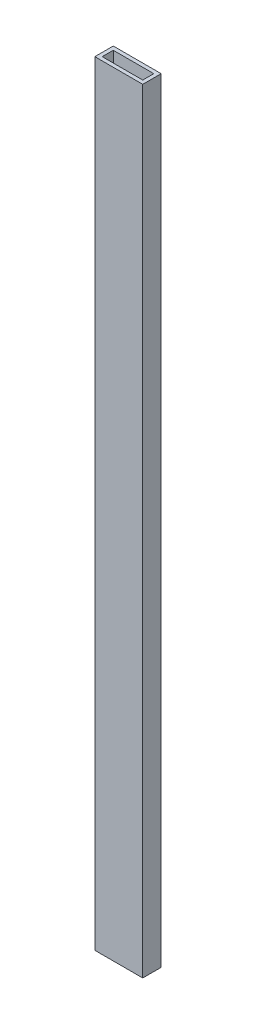
ISO-10303-21;
HEADER;
FILE_DESCRIPTION(('STEP AP214'),'2;1');
FILE_NAME('part.step','',(''),(''),'','','');
FILE_SCHEMA(('AUTOMOTIVE_DESIGN { 1 0 10303 214 1 1 1 1 }'));
ENDSEC;
DATA;
#1=APPLICATION_CONTEXT('core data for automotive mechanical design processes');
#2=APPLICATION_PROTOCOL_DEFINITION('international standard','automotive_design',2000,#1);
#3=PRODUCT_CONTEXT('',#1,'mechanical');
#4=PRODUCT('Part','Part','',(#3));
#5=PRODUCT_RELATED_PRODUCT_CATEGORY('part','',(#4));
#6=PRODUCT_DEFINITION_FORMATION('','',#4);
#7=PRODUCT_DEFINITION_CONTEXT('part definition',#1,'design');
#8=PRODUCT_DEFINITION('design','',#6,#7);
#9=PRODUCT_DEFINITION_SHAPE('','',#8);
#10=(LENGTH_UNIT() NAMED_UNIT(*) SI_UNIT(.MILLI.,.METRE.));
#11=(NAMED_UNIT(*) PLANE_ANGLE_UNIT() SI_UNIT($,.RADIAN.));
#12=(NAMED_UNIT(*) SI_UNIT($,.STERADIAN.) SOLID_ANGLE_UNIT());
#13=UNCERTAINTY_MEASURE_WITH_UNIT(LENGTH_MEASURE(1.E-05),#10,'distance_accuracy_value','');
#14=(GEOMETRIC_REPRESENTATION_CONTEXT(3) GLOBAL_UNCERTAINTY_ASSIGNED_CONTEXT((#13)) GLOBAL_UNIT_ASSIGNED_CONTEXT((#10,
#11,#12)) REPRESENTATION_CONTEXT('',''));
#15=CARTESIAN_POINT('',(0.,0.,0.));
#16=DIRECTION('',(0.,0.,1.));
#17=DIRECTION('',(1.,0.,0.));
#18=AXIS2_PLACEMENT_3D('',#15,#16,#17);
#19=CARTESIAN_POINT('',(0.,666.75,0.));
#20=DIRECTION('',(0.,-1.,0.));
#21=DIRECTION('',(0.,0.,-1.));
#22=AXIS2_PLACEMENT_3D('',#19,#20,#21);
#23=PLANE('',#22);
#24=DIRECTION('',(-1.,0.,0.));
#25=VECTOR('',#24,1.);
#26=CARTESIAN_POINT('',(-20.6375,666.75,-7.9375));
#27=LINE('',#26,#25);
#28=CARTESIAN_POINT('',(20.6375,666.75,-7.9375));
#29=VERTEX_POINT('',#28);
#30=CARTESIAN_POINT('',(-20.6375,666.75,-7.9375));
#31=VERTEX_POINT('',#30);
#32=EDGE_CURVE('E157',#29,#31,#27,.T.);
#33=ORIENTED_EDGE('',*,*,#32,.T.);
#34=DIRECTION('',(0.,0.,1.));
#35=VECTOR('',#34,1.);
#36=CARTESIAN_POINT('',(-20.6375,666.75,-7.9375));
#37=LINE('',#36,#35);
#38=CARTESIAN_POINT('',(-20.6375,666.75,7.9375));
#39=VERTEX_POINT('',#38);
#40=EDGE_CURVE('E161',#31,#39,#37,.T.);
#41=ORIENTED_EDGE('',*,*,#40,.T.);
#42=DIRECTION('',(1.,0.,0.));
#43=VECTOR('',#42,1.);
#44=CARTESIAN_POINT('',(-20.6375,666.75,7.9375));
#45=LINE('',#44,#43);
#46=CARTESIAN_POINT('',(20.6375,666.75,7.9375));
#47=VERTEX_POINT('',#46);
#48=EDGE_CURVE('E165',#39,#47,#45,.T.);
#49=ORIENTED_EDGE('',*,*,#48,.T.);
#50=DIRECTION('',(0.,0.,-1.));
#51=VECTOR('',#50,1.);
#52=CARTESIAN_POINT('',(20.6375,666.75,-7.9375));
#53=LINE('',#52,#51);
#54=EDGE_CURVE('E168',#47,#29,#53,.T.);
#55=ORIENTED_EDGE('',*,*,#54,.T.);
#56=EDGE_LOOP('',(#33,#41,#49,#55));
#57=FACE_BOUND('',#56,.T.);
#58=DIRECTION('',(0.,0.,-1.));
#59=VECTOR('',#58,1.);
#60=CARTESIAN_POINT('',(17.4625,666.75,-4.7625));
#61=LINE('',#60,#59);
#62=CARTESIAN_POINT('',(17.4625,666.75,4.7625));
#63=VERTEX_POINT('',#62);
#64=CARTESIAN_POINT('',(17.4625,666.75,-4.7625));
#65=VERTEX_POINT('',#64);
#66=EDGE_CURVE('E109',#63,#65,#61,.T.);
#67=ORIENTED_EDGE('',*,*,#66,.F.);
#68=DIRECTION('',(1.,0.,0.));
#69=VECTOR('',#68,1.);
#70=CARTESIAN_POINT('',(-17.4625,666.75,4.7625));
#71=LINE('',#70,#69);
#72=CARTESIAN_POINT('',(-17.4625,666.75,4.7625));
#73=VERTEX_POINT('',#72);
#74=EDGE_CURVE('E135',#73,#63,#71,.T.);
#75=ORIENTED_EDGE('',*,*,#74,.F.);
#76=DIRECTION('',(0.,0.,1.));
#77=VECTOR('',#76,1.);
#78=CARTESIAN_POINT('',(-17.4625,666.75,-4.7625));
#79=LINE('',#78,#77);
#80=CARTESIAN_POINT('',(-17.4625,666.75,-4.7625));
#81=VERTEX_POINT('',#80);
#82=EDGE_CURVE('E131',#81,#73,#79,.T.);
#83=ORIENTED_EDGE('',*,*,#82,.F.);
#84=DIRECTION('',(-1.,0.,0.));
#85=VECTOR('',#84,1.);
#86=CARTESIAN_POINT('',(-17.4625,666.75,-4.7625));
#87=LINE('',#86,#85);
#88=EDGE_CURVE('E118',#65,#81,#87,.T.);
#89=ORIENTED_EDGE('',*,*,#88,.F.);
#90=EDGE_LOOP('',(#67,#75,#83,#89));
#91=FACE_BOUND('',#90,.T.);
#92=ADVANCED_FACE('F43',(#57,#91),#23,.F.);
#93=CARTESIAN_POINT('',(0.,0.,0.));
#94=DIRECTION('',(0.,-1.,0.));
#95=DIRECTION('',(0.,0.,-1.));
#96=AXIS2_PLACEMENT_3D('',#93,#94,#95);
#97=PLANE('',#96);
#98=DIRECTION('',(-1.,0.,0.));
#99=VECTOR('',#98,1.);
#100=CARTESIAN_POINT('',(-20.6375,0.,-7.9375));
#101=LINE('',#100,#99);
#102=CARTESIAN_POINT('',(20.6375,0.,-7.9375));
#103=VERTEX_POINT('',#102);
#104=CARTESIAN_POINT('',(-20.6375,0.,-7.9375));
#105=VERTEX_POINT('',#104);
#106=EDGE_CURVE('E127',#103,#105,#101,.T.);
#107=ORIENTED_EDGE('',*,*,#106,.F.);
#108=DIRECTION('',(0.,0.,-1.));
#109=VECTOR('',#108,1.);
#110=CARTESIAN_POINT('',(20.6375,0.,-7.9375));
#111=LINE('',#110,#109);
#112=CARTESIAN_POINT('',(20.6375,0.,7.9375));
#113=VERTEX_POINT('',#112);
#114=EDGE_CURVE('E162',#113,#103,#111,.T.);
#115=ORIENTED_EDGE('',*,*,#114,.F.);
#116=DIRECTION('',(1.,0.,0.));
#117=VECTOR('',#116,1.);
#118=CARTESIAN_POINT('',(-20.6375,0.,7.9375));
#119=LINE('',#118,#117);
#120=CARTESIAN_POINT('',(-20.6375,0.,7.9375));
#121=VERTEX_POINT('',#120);
#122=EDGE_CURVE('E178',#121,#113,#119,.T.);
#123=ORIENTED_EDGE('',*,*,#122,.F.);
#124=DIRECTION('',(0.,0.,1.));
#125=VECTOR('',#124,1.);
#126=CARTESIAN_POINT('',(-20.6375,0.,-7.9375));
#127=LINE('',#126,#125);
#128=EDGE_CURVE('E175',#105,#121,#127,.T.);
#129=ORIENTED_EDGE('',*,*,#128,.F.);
#130=EDGE_LOOP('',(#107,#115,#123,#129));
#131=FACE_BOUND('',#130,.T.);
#132=DIRECTION('',(1.,0.,0.));
#133=VECTOR('',#132,1.);
#134=CARTESIAN_POINT('',(-17.4625,0.,4.7625));
#135=LINE('',#134,#133);
#136=CARTESIAN_POINT('',(-17.4625,0.,4.7625));
#137=VERTEX_POINT('',#136);
#138=CARTESIAN_POINT('',(17.4625,0.,4.7625));
#139=VERTEX_POINT('',#138);
#140=EDGE_CURVE('E119',#137,#139,#135,.T.);
#141=ORIENTED_EDGE('',*,*,#140,.T.);
#142=DIRECTION('',(0.,0.,-1.));
#143=VECTOR('',#142,1.);
#144=CARTESIAN_POINT('',(17.4625,0.,-4.7625));
#145=LINE('',#144,#143);
#146=CARTESIAN_POINT('',(17.4625,0.,-4.7625));
#147=VERTEX_POINT('',#146);
#148=EDGE_CURVE('E67',#139,#147,#145,.T.);
#149=ORIENTED_EDGE('',*,*,#148,.T.);
#150=DIRECTION('',(-1.,0.,0.));
#151=VECTOR('',#150,1.);
#152=CARTESIAN_POINT('',(-17.4625,0.,-4.7625));
#153=LINE('',#152,#151);
#154=CARTESIAN_POINT('',(-17.4625,0.,-4.7625));
#155=VERTEX_POINT('',#154);
#156=EDGE_CURVE('E125',#147,#155,#153,.T.);
#157=ORIENTED_EDGE('',*,*,#156,.T.);
#158=DIRECTION('',(0.,0.,1.));
#159=VECTOR('',#158,1.);
#160=CARTESIAN_POINT('',(-17.4625,0.,-4.7625));
#161=LINE('',#160,#159);
#162=EDGE_CURVE('E144',#155,#137,#161,.T.);
#163=ORIENTED_EDGE('',*,*,#162,.T.);
#164=EDGE_LOOP('',(#141,#149,#157,#163));
#165=FACE_BOUND('',#164,.T.);
#166=ADVANCED_FACE('F201',(#131,#165),#97,.T.);
#167=CARTESIAN_POINT('',(-20.6375,666.75,-7.9375));
#168=DIRECTION('',(0.,0.,1.));
#169=DIRECTION('',(1.,0.,0.));
#170=AXIS2_PLACEMENT_3D('',#167,#168,#169);
#171=PLANE('',#170);
#172=ORIENTED_EDGE('',*,*,#106,.T.);
#173=DIRECTION('',(0.,-1.,0.));
#174=VECTOR('',#173,1.);
#175=CARTESIAN_POINT('',(-20.6375,666.75,-7.9375));
#176=LINE('',#175,#174);
#177=EDGE_CURVE('E11',#31,#105,#176,.T.);
#178=ORIENTED_EDGE('',*,*,#177,.F.);
#179=ORIENTED_EDGE('',*,*,#32,.F.);
#180=DIRECTION('',(0.,-1.,0.));
#181=VECTOR('',#180,1.);
#182=CARTESIAN_POINT('',(20.6375,666.75,-7.9375));
#183=LINE('',#182,#181);
#184=EDGE_CURVE('E171',#29,#103,#183,.T.);
#185=ORIENTED_EDGE('',*,*,#184,.T.);
#186=EDGE_LOOP('',(#172,#178,#179,#185));
#187=FACE_BOUND('',#186,.T.);
#188=ADVANCED_FACE('F45',(#187),#171,.F.);
#189=CARTESIAN_POINT('',(-20.6375,666.75,-7.9375));
#190=DIRECTION('',(1.,0.,0.));
#191=DIRECTION('',(0.,0.,-1.));
#192=AXIS2_PLACEMENT_3D('',#189,#190,#191);
#193=PLANE('',#192);
#194=ORIENTED_EDGE('',*,*,#128,.T.);
#195=DIRECTION('',(0.,-1.,0.));
#196=VECTOR('',#195,1.);
#197=CARTESIAN_POINT('',(-20.6375,666.75,7.9375));
#198=LINE('',#197,#196);
#199=EDGE_CURVE('E52',#39,#121,#198,.T.);
#200=ORIENTED_EDGE('',*,*,#199,.F.);
#201=ORIENTED_EDGE('',*,*,#40,.F.);
#202=ORIENTED_EDGE('',*,*,#177,.T.);
#203=EDGE_LOOP('',(#194,#200,#201,#202));
#204=FACE_BOUND('',#203,.T.);
#205=ADVANCED_FACE('F211',(#204),#193,.F.);
#206=CARTESIAN_POINT('',(-20.6375,666.75,7.9375));
#207=DIRECTION('',(0.,0.,-1.));
#208=DIRECTION('',(-1.,0.,0.));
#209=AXIS2_PLACEMENT_3D('',#206,#207,#208);
#210=PLANE('',#209);
#211=ORIENTED_EDGE('',*,*,#122,.T.);
#212=DIRECTION('',(0.,-1.,0.));
#213=VECTOR('',#212,1.);
#214=CARTESIAN_POINT('',(20.6375,666.75,7.9375));
#215=LINE('',#214,#213);
#216=EDGE_CURVE('E186',#47,#113,#215,.T.);
#217=ORIENTED_EDGE('',*,*,#216,.F.);
#218=ORIENTED_EDGE('',*,*,#48,.F.);
#219=ORIENTED_EDGE('',*,*,#199,.T.);
#220=EDGE_LOOP('',(#211,#217,#218,#219));
#221=FACE_BOUND('',#220,.T.);
#222=ADVANCED_FACE('F195',(#221),#210,.F.);
#223=CARTESIAN_POINT('',(20.6375,666.75,-7.9375));
#224=DIRECTION('',(-1.,0.,0.));
#225=DIRECTION('',(0.,0.,1.));
#226=AXIS2_PLACEMENT_3D('',#223,#224,#225);
#227=PLANE('',#226);
#228=ORIENTED_EDGE('',*,*,#114,.T.);
#229=ORIENTED_EDGE('',*,*,#184,.F.);
#230=ORIENTED_EDGE('',*,*,#54,.F.);
#231=ORIENTED_EDGE('',*,*,#216,.T.);
#232=EDGE_LOOP('',(#228,#229,#230,#231));
#233=FACE_BOUND('',#232,.T.);
#234=ADVANCED_FACE('F205',(#233),#227,.F.);
#235=CARTESIAN_POINT('',(17.4625,666.75,-4.7625));
#236=DIRECTION('',(-1.,0.,0.));
#237=DIRECTION('',(0.,0.,1.));
#238=AXIS2_PLACEMENT_3D('',#235,#236,#237);
#239=PLANE('',#238);
#240=ORIENTED_EDGE('',*,*,#148,.F.);
#241=DIRECTION('',(0.,-1.,0.));
#242=VECTOR('',#241,1.);
#243=CARTESIAN_POINT('',(17.4625,666.75,4.7625));
#244=LINE('',#243,#242);
#245=EDGE_CURVE('E113',#63,#139,#244,.T.);
#246=ORIENTED_EDGE('',*,*,#245,.F.);
#247=ORIENTED_EDGE('',*,*,#66,.T.);
#248=DIRECTION('',(0.,-1.,0.));
#249=VECTOR('',#248,1.);
#250=CARTESIAN_POINT('',(17.4625,666.75,-4.7625));
#251=LINE('',#250,#249);
#252=EDGE_CURVE('E112',#65,#147,#251,.T.);
#253=ORIENTED_EDGE('',*,*,#252,.T.);
#254=EDGE_LOOP('',(#240,#246,#247,#253));
#255=FACE_BOUND('',#254,.T.);
#256=ADVANCED_FACE('F111',(#255),#239,.T.);
#257=CARTESIAN_POINT('',(-17.4625,666.75,-4.7625));
#258=DIRECTION('',(0.,0.,1.));
#259=DIRECTION('',(1.,0.,0.));
#260=AXIS2_PLACEMENT_3D('',#257,#258,#259);
#261=PLANE('',#260);
#262=ORIENTED_EDGE('',*,*,#156,.F.);
#263=ORIENTED_EDGE('',*,*,#252,.F.);
#264=ORIENTED_EDGE('',*,*,#88,.T.);
#265=DIRECTION('',(0.,-1.,0.));
#266=VECTOR('',#265,1.);
#267=CARTESIAN_POINT('',(-17.4625,666.75,-4.7625));
#268=LINE('',#267,#266);
#269=EDGE_CURVE('E128',#81,#155,#268,.T.);
#270=ORIENTED_EDGE('',*,*,#269,.T.);
#271=EDGE_LOOP('',(#262,#263,#264,#270));
#272=FACE_BOUND('',#271,.T.);
#273=ADVANCED_FACE('F122',(#272),#261,.T.);
#274=CARTESIAN_POINT('',(-17.4625,666.75,-4.7625));
#275=DIRECTION('',(1.,0.,0.));
#276=DIRECTION('',(0.,0.,-1.));
#277=AXIS2_PLACEMENT_3D('',#274,#275,#276);
#278=PLANE('',#277);
#279=ORIENTED_EDGE('',*,*,#162,.F.);
#280=ORIENTED_EDGE('',*,*,#269,.F.);
#281=ORIENTED_EDGE('',*,*,#82,.T.);
#282=DIRECTION('',(0.,-1.,0.));
#283=VECTOR('',#282,1.);
#284=CARTESIAN_POINT('',(-17.4625,666.75,4.7625));
#285=LINE('',#284,#283);
#286=EDGE_CURVE('E59',#73,#137,#285,.T.);
#287=ORIENTED_EDGE('',*,*,#286,.T.);
#288=EDGE_LOOP('',(#279,#280,#281,#287));
#289=FACE_BOUND('',#288,.T.);
#290=ADVANCED_FACE('F234',(#289),#278,.T.);
#291=CARTESIAN_POINT('',(-17.4625,666.75,4.7625));
#292=DIRECTION('',(0.,0.,-1.));
#293=DIRECTION('',(-1.,0.,0.));
#294=AXIS2_PLACEMENT_3D('',#291,#292,#293);
#295=PLANE('',#294);
#296=ORIENTED_EDGE('',*,*,#140,.F.);
#297=ORIENTED_EDGE('',*,*,#286,.F.);
#298=ORIENTED_EDGE('',*,*,#74,.T.);
#299=ORIENTED_EDGE('',*,*,#245,.T.);
#300=EDGE_LOOP('',(#296,#297,#298,#299));
#301=FACE_BOUND('',#300,.T.);
#302=ADVANCED_FACE('F238',(#301),#295,.T.);
#303=CLOSED_SHELL('',(#92,#166,#188,#205,#222,#234,#256,#273,#290,#302));
#304=MANIFOLD_SOLID_BREP('B2',#303);
#305=ADVANCED_BREP_SHAPE_REPRESENTATION('',(#18,#304),#14);
#306=SHAPE_DEFINITION_REPRESENTATION(#9,#305);
ENDSEC;
END-ISO-10303-21;
